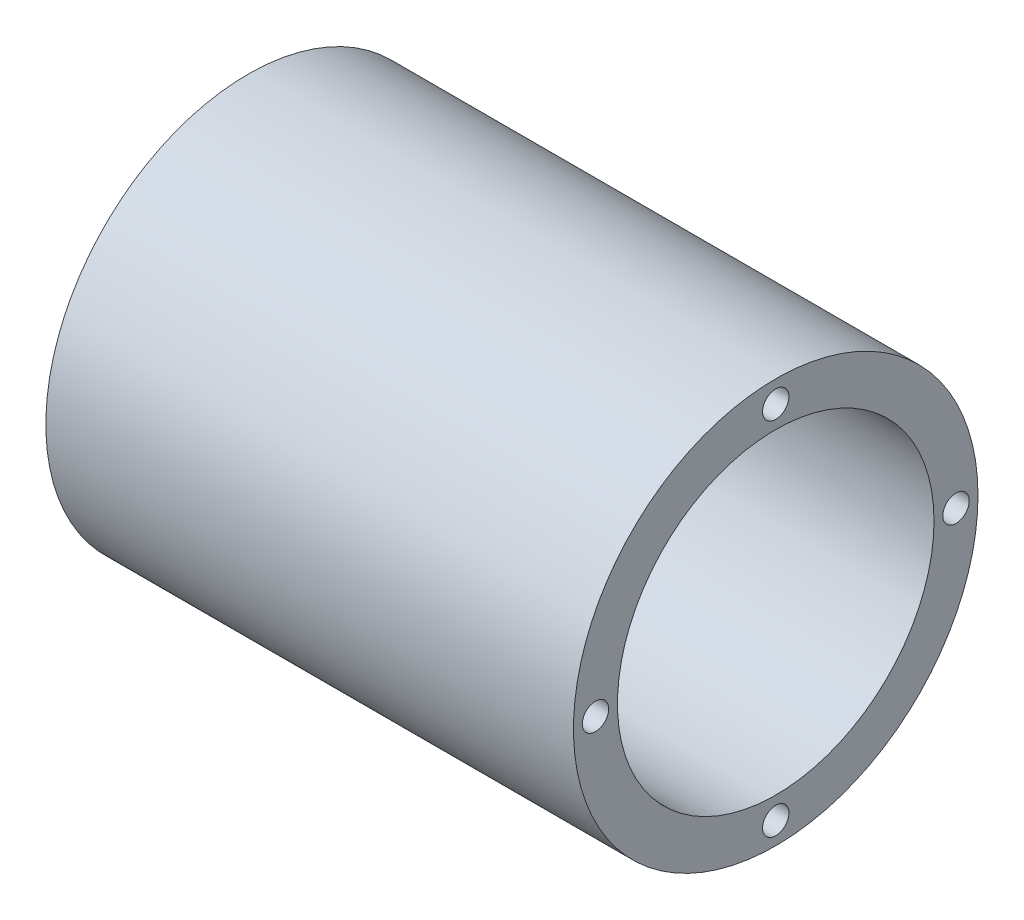
ISO-10303-21;
HEADER;
FILE_DESCRIPTION(('STEP AP214'),'2;1');
FILE_NAME('part.step','',(''),(''),'','','');
FILE_SCHEMA(('AUTOMOTIVE_DESIGN { 1 0 10303 214 1 1 1 1 }'));
ENDSEC;
DATA;
#1=APPLICATION_CONTEXT('core data for automotive mechanical design processes');
#2=APPLICATION_PROTOCOL_DEFINITION('international standard','automotive_design',2000,#1);
#3=PRODUCT_CONTEXT('',#1,'mechanical');
#4=PRODUCT('Part','Part','',(#3));
#5=PRODUCT_RELATED_PRODUCT_CATEGORY('part','',(#4));
#6=PRODUCT_DEFINITION_FORMATION('','',#4);
#7=PRODUCT_DEFINITION_CONTEXT('part definition',#1,'design');
#8=PRODUCT_DEFINITION('design','',#6,#7);
#9=PRODUCT_DEFINITION_SHAPE('','',#8);
#10=(LENGTH_UNIT() NAMED_UNIT(*) SI_UNIT(.MILLI.,.METRE.));
#11=(NAMED_UNIT(*) PLANE_ANGLE_UNIT() SI_UNIT($,.RADIAN.));
#12=(NAMED_UNIT(*) SI_UNIT($,.STERADIAN.) SOLID_ANGLE_UNIT());
#13=UNCERTAINTY_MEASURE_WITH_UNIT(LENGTH_MEASURE(1.E-05),#10,'distance_accuracy_value','');
#14=(GEOMETRIC_REPRESENTATION_CONTEXT(3) GLOBAL_UNCERTAINTY_ASSIGNED_CONTEXT((#13)) GLOBAL_UNIT_ASSIGNED_CONTEXT((#10,
#11,#12)) REPRESENTATION_CONTEXT('',''));
#15=CARTESIAN_POINT('',(0.,0.,0.));
#16=DIRECTION('',(0.,0.,1.));
#17=DIRECTION('',(1.,0.,0.));
#18=AXIS2_PLACEMENT_3D('',#15,#16,#17);
#19=CARTESIAN_POINT('',(3.,0.,-8.5));
#20=DIRECTION('',(-1.,0.,0.));
#21=DIRECTION('',(0.,0.,1.));
#22=AXIS2_PLACEMENT_3D('',#19,#20,#21);
#23=CYLINDRICAL_SURFACE('',#22,3.);
#24=CARTESIAN_POINT('',(0.,0.,-8.5));
#25=DIRECTION('',(1.,0.,0.));
#26=DIRECTION('',(0.,0.,-1.));
#27=AXIS2_PLACEMENT_3D('',#24,#25,#26);
#28=CIRCLE('',#27,3.);
#29=CARTESIAN_POINT('',(0.,0.,-11.5));
#30=VERTEX_POINT('',#29);
#31=EDGE_CURVE('E109',#30,#30,#28,.T.);
#32=ORIENTED_EDGE('',*,*,#31,.F.);
#33=EDGE_LOOP('',(#32));
#34=FACE_BOUND('',#33,.T.);
#35=CARTESIAN_POINT('',(3.,0.,-8.5));
#36=DIRECTION('',(1.,0.,0.));
#37=DIRECTION('',(0.,0.,-1.));
#38=AXIS2_PLACEMENT_3D('',#35,#36,#37);
#39=CIRCLE('',#38,3.);
#40=CARTESIAN_POINT('',(3.,0.,-11.5));
#41=VERTEX_POINT('',#40);
#42=EDGE_CURVE('E161',#41,#41,#39,.T.);
#43=ORIENTED_EDGE('',*,*,#42,.T.);
#44=EDGE_LOOP('',(#43));
#45=FACE_BOUND('',#44,.T.);
#46=ADVANCED_FACE('F89',(#34,#45),#23,.F.);
#47=CARTESIAN_POINT('',(3.,-8.5,0.));
#48=DIRECTION('',(-1.,0.,0.));
#49=DIRECTION('',(0.,0.,1.));
#50=AXIS2_PLACEMENT_3D('',#47,#48,#49);
#51=CYLINDRICAL_SURFACE('',#50,3.);
#52=CARTESIAN_POINT('',(0.,-8.5,0.));
#53=DIRECTION('',(1.,0.,0.));
#54=DIRECTION('',(0.,0.,-1.));
#55=AXIS2_PLACEMENT_3D('',#52,#53,#54);
#56=CIRCLE('',#55,3.);
#57=CARTESIAN_POINT('',(0.,-8.5,-2.99999999999994));
#58=VERTEX_POINT('',#57);
#59=EDGE_CURVE('E100',#58,#58,#56,.T.);
#60=ORIENTED_EDGE('',*,*,#59,.F.);
#61=EDGE_LOOP('',(#60));
#62=FACE_BOUND('',#61,.T.);
#63=CARTESIAN_POINT('',(3.,-8.5,0.));
#64=DIRECTION('',(1.,0.,0.));
#65=DIRECTION('',(0.,0.,-1.));
#66=AXIS2_PLACEMENT_3D('',#63,#64,#65);
#67=CIRCLE('',#66,3.);
#68=CARTESIAN_POINT('',(3.,-8.5,-2.99999999999994));
#69=VERTEX_POINT('',#68);
#70=EDGE_CURVE('E152',#69,#69,#67,.T.);
#71=ORIENTED_EDGE('',*,*,#70,.T.);
#72=EDGE_LOOP('',(#71));
#73=FACE_BOUND('',#72,.T.);
#74=ADVANCED_FACE('F207',(#62,#73),#51,.F.);
#75=CARTESIAN_POINT('',(3.,0.,8.5));
#76=DIRECTION('',(-1.,0.,0.));
#77=DIRECTION('',(0.,0.,1.));
#78=AXIS2_PLACEMENT_3D('',#75,#76,#77);
#79=CYLINDRICAL_SURFACE('',#78,3.);
#80=CARTESIAN_POINT('',(0.,0.,8.5));
#81=DIRECTION('',(1.,0.,0.));
#82=DIRECTION('',(0.,0.,-1.));
#83=AXIS2_PLACEMENT_3D('',#80,#81,#82);
#84=CIRCLE('',#83,3.);
#85=CARTESIAN_POINT('',(0.,0.,5.5));
#86=VERTEX_POINT('',#85);
#87=EDGE_CURVE('E112',#86,#86,#84,.T.);
#88=ORIENTED_EDGE('',*,*,#87,.F.);
#89=EDGE_LOOP('',(#88));
#90=FACE_BOUND('',#89,.T.);
#91=CARTESIAN_POINT('',(3.,0.,8.5));
#92=DIRECTION('',(1.,0.,0.));
#93=DIRECTION('',(0.,0.,-1.));
#94=AXIS2_PLACEMENT_3D('',#91,#92,#93);
#95=CIRCLE('',#94,3.);
#96=CARTESIAN_POINT('',(3.,0.,5.5));
#97=VERTEX_POINT('',#96);
#98=EDGE_CURVE('E143',#97,#97,#95,.T.);
#99=ORIENTED_EDGE('',*,*,#98,.T.);
#100=EDGE_LOOP('',(#99));
#101=FACE_BOUND('',#100,.T.);
#102=ADVANCED_FACE('F213',(#90,#101),#79,.F.);
#103=CARTESIAN_POINT('',(3.,8.5,0.));
#104=DIRECTION('',(-1.,0.,0.));
#105=DIRECTION('',(0.,0.,1.));
#106=AXIS2_PLACEMENT_3D('',#103,#104,#105);
#107=CYLINDRICAL_SURFACE('',#106,3.);
#108=CARTESIAN_POINT('',(0.,8.5,0.));
#109=DIRECTION('',(1.,0.,0.));
#110=DIRECTION('',(0.,0.,-1.));
#111=AXIS2_PLACEMENT_3D('',#108,#109,#110);
#112=CIRCLE('',#111,3.);
#113=CARTESIAN_POINT('',(0.,8.5,-3.));
#114=VERTEX_POINT('',#113);
#115=EDGE_CURVE('E96',#114,#114,#112,.T.);
#116=ORIENTED_EDGE('',*,*,#115,.F.);
#117=EDGE_LOOP('',(#116));
#118=FACE_BOUND('',#117,.T.);
#119=CARTESIAN_POINT('',(3.,8.5,0.));
#120=DIRECTION('',(1.,0.,0.));
#121=DIRECTION('',(0.,0.,-1.));
#122=AXIS2_PLACEMENT_3D('',#119,#120,#121);
#123=CIRCLE('',#122,3.);
#124=CARTESIAN_POINT('',(3.,8.5,-3.));
#125=VERTEX_POINT('',#124);
#126=EDGE_CURVE('E129',#125,#125,#123,.T.);
#127=ORIENTED_EDGE('',*,*,#126,.T.);
#128=EDGE_LOOP('',(#127));
#129=FACE_BOUND('',#128,.T.);
#130=ADVANCED_FACE('F221',(#118,#129),#107,.F.);
#131=CARTESIAN_POINT('',(-11.,0.,0.));
#132=DIRECTION('',(1.,0.,0.));
#133=DIRECTION('',(0.,0.,-1.));
#134=AXIS2_PLACEMENT_3D('',#131,#132,#133);
#135=CYLINDRICAL_SURFACE('',#134,23.);
#136=CARTESIAN_POINT('',(0.,0.,0.));
#137=DIRECTION('',(1.,0.,0.));
#138=DIRECTION('',(0.,0.,-1.));
#139=AXIS2_PLACEMENT_3D('',#136,#137,#138);
#140=CIRCLE('',#139,23.);
#141=CARTESIAN_POINT('',(0.,0.,-23.));
#142=VERTEX_POINT('',#141);
#143=EDGE_CURVE('E170',#142,#142,#140,.T.);
#144=ORIENTED_EDGE('',*,*,#143,.T.);
#145=EDGE_LOOP('',(#144));
#146=FACE_BOUND('',#145,.T.);
#147=CARTESIAN_POINT('',(60.,0.,0.));
#148=DIRECTION('',(1.,0.,0.));
#149=DIRECTION('',(0.,0.,-1.));
#150=AXIS2_PLACEMENT_3D('',#147,#148,#149);
#151=CIRCLE('',#150,23.);
#152=CARTESIAN_POINT('',(60.,0.,-23.));
#153=VERTEX_POINT('',#152);
#154=EDGE_CURVE('E118',#153,#153,#151,.T.);
#155=ORIENTED_EDGE('',*,*,#154,.F.);
#156=EDGE_LOOP('',(#155));
#157=FACE_BOUND('',#156,.T.);
#158=ADVANCED_FACE('F91',(#146,#157),#135,.T.);
#159=CARTESIAN_POINT('',(0.,0.,0.));
#160=DIRECTION('',(1.,0.,0.));
#161=DIRECTION('',(0.,0.,-1.));
#162=AXIS2_PLACEMENT_3D('',#159,#160,#161);
#163=PLANE('',#162);
#164=ORIENTED_EDGE('',*,*,#115,.T.);
#165=EDGE_LOOP('',(#164));
#166=FACE_BOUND('',#165,.T.);
#167=ORIENTED_EDGE('',*,*,#59,.T.);
#168=EDGE_LOOP('',(#167));
#169=FACE_BOUND('',#168,.T.);
#170=CARTESIAN_POINT('',(0.,0.,0.));
#171=DIRECTION('',(1.,0.,0.));
#172=DIRECTION('',(0.,0.,-1.));
#173=AXIS2_PLACEMENT_3D('',#170,#171,#172);
#174=CIRCLE('',#173,5.25);
#175=CARTESIAN_POINT('',(0.,0.,-5.25));
#176=VERTEX_POINT('',#175);
#177=EDGE_CURVE('E104',#176,#176,#174,.T.);
#178=ORIENTED_EDGE('',*,*,#177,.T.);
#179=EDGE_LOOP('',(#178));
#180=FACE_BOUND('',#179,.T.);
#181=ORIENTED_EDGE('',*,*,#31,.T.);
#182=EDGE_LOOP('',(#181));
#183=FACE_BOUND('',#182,.T.);
#184=ORIENTED_EDGE('',*,*,#87,.T.);
#185=EDGE_LOOP('',(#184));
#186=FACE_BOUND('',#185,.T.);
#187=ORIENTED_EDGE('',*,*,#143,.F.);
#188=EDGE_LOOP('',(#187));
#189=FACE_BOUND('',#188,.T.);
#190=ADVANCED_FACE('F344',(#166,#169,#180,#183,#186,#189),#163,.F.);
#191=CARTESIAN_POINT('',(3.,0.,0.));
#192=DIRECTION('',(-1.,0.,0.));
#193=DIRECTION('',(0.,0.,1.));
#194=AXIS2_PLACEMENT_3D('',#191,#192,#193);
#195=CYLINDRICAL_SURFACE('',#194,5.25);
#196=ORIENTED_EDGE('',*,*,#177,.F.);
#197=EDGE_LOOP('',(#196));
#198=FACE_BOUND('',#197,.T.);
#199=CARTESIAN_POINT('',(6.,0.,0.));
#200=DIRECTION('',(1.,0.,0.));
#201=DIRECTION('',(0.,0.,-1.));
#202=AXIS2_PLACEMENT_3D('',#199,#200,#201);
#203=CIRCLE('',#202,5.25);
#204=CARTESIAN_POINT('',(6.,0.,-5.25));
#205=VERTEX_POINT('',#204);
#206=EDGE_CURVE('E115',#205,#205,#203,.T.);
#207=ORIENTED_EDGE('',*,*,#206,.T.);
#208=EDGE_LOOP('',(#207));
#209=FACE_BOUND('',#208,.T.);
#210=ADVANCED_FACE('F219',(#198,#209),#195,.F.);
#211=CARTESIAN_POINT('',(6.,0.,0.));
#212=DIRECTION('',(1.,0.,0.));
#213=DIRECTION('',(0.,0.,-1.));
#214=AXIS2_PLACEMENT_3D('',#211,#212,#213);
#215=PLANE('',#214);
#216=CARTESIAN_POINT('',(6.,0.,0.));
#217=DIRECTION('',(1.,0.,0.));
#218=DIRECTION('',(0.,0.,-1.));
#219=AXIS2_PLACEMENT_3D('',#216,#217,#218);
#220=CIRCLE('',#219,18.);
#221=CARTESIAN_POINT('',(6.,0.,-18.));
#222=VERTEX_POINT('',#221);
#223=EDGE_CURVE('E11',#222,#222,#220,.F.);
#224=ORIENTED_EDGE('',*,*,#223,.F.);
#225=EDGE_LOOP('',(#224));
#226=FACE_BOUND('',#225,.T.);
#227=ORIENTED_EDGE('',*,*,#206,.F.);
#228=EDGE_LOOP('',(#227));
#229=FACE_BOUND('',#228,.T.);
#230=CARTESIAN_POINT('',(6.,8.5,0.));
#231=DIRECTION('',(1.,0.,0.));
#232=DIRECTION('',(0.,0.,-1.));
#233=AXIS2_PLACEMENT_3D('',#230,#231,#232);
#234=CIRCLE('',#233,1.5);
#235=CARTESIAN_POINT('',(6.,8.5,-1.5));
#236=VERTEX_POINT('',#235);
#237=EDGE_CURVE('E140',#236,#236,#234,.T.);
#238=ORIENTED_EDGE('',*,*,#237,.F.);
#239=EDGE_LOOP('',(#238));
#240=FACE_BOUND('',#239,.T.);
#241=CARTESIAN_POINT('',(6.,0.,8.5));
#242=DIRECTION('',(1.,0.,0.));
#243=DIRECTION('',(0.,0.,-1.));
#244=AXIS2_PLACEMENT_3D('',#241,#242,#243);
#245=CIRCLE('',#244,1.5);
#246=CARTESIAN_POINT('',(6.,0.,7.));
#247=VERTEX_POINT('',#246);
#248=EDGE_CURVE('E149',#247,#247,#245,.T.);
#249=ORIENTED_EDGE('',*,*,#248,.F.);
#250=EDGE_LOOP('',(#249));
#251=FACE_BOUND('',#250,.T.);
#252=CARTESIAN_POINT('',(6.,-8.5,0.));
#253=DIRECTION('',(1.,0.,0.));
#254=DIRECTION('',(0.,0.,-1.));
#255=AXIS2_PLACEMENT_3D('',#252,#253,#254);
#256=CIRCLE('',#255,1.5);
#257=CARTESIAN_POINT('',(6.,-8.5,-1.49999999999994));
#258=VERTEX_POINT('',#257);
#259=EDGE_CURVE('E158',#258,#258,#256,.T.);
#260=ORIENTED_EDGE('',*,*,#259,.F.);
#261=EDGE_LOOP('',(#260));
#262=FACE_BOUND('',#261,.T.);
#263=CARTESIAN_POINT('',(6.,0.,-8.5));
#264=DIRECTION('',(1.,0.,0.));
#265=DIRECTION('',(0.,0.,-1.));
#266=AXIS2_PLACEMENT_3D('',#263,#264,#265);
#267=CIRCLE('',#266,1.5);
#268=CARTESIAN_POINT('',(6.,0.,-10.));
#269=VERTEX_POINT('',#268);
#270=EDGE_CURVE('E167',#269,#269,#267,.T.);
#271=ORIENTED_EDGE('',*,*,#270,.F.);
#272=EDGE_LOOP('',(#271));
#273=FACE_BOUND('',#272,.T.);
#274=ADVANCED_FACE('F396',(#226,#229,#240,#251,#262,#273),#215,.T.);
#275=CARTESIAN_POINT('',(60.,0.,0.));
#276=DIRECTION('',(-1.,0.,0.));
#277=DIRECTION('',(0.,0.,1.));
#278=AXIS2_PLACEMENT_3D('',#275,#276,#277);
#279=CYLINDRICAL_SURFACE('',#278,18.);
#280=ORIENTED_EDGE('',*,*,#223,.T.);
#281=EDGE_LOOP('',(#280));
#282=FACE_BOUND('',#281,.T.);
#283=CARTESIAN_POINT('',(60.,0.,0.));
#284=DIRECTION('',(1.,0.,0.));
#285=DIRECTION('',(0.,0.,-1.));
#286=AXIS2_PLACEMENT_3D('',#283,#284,#285);
#287=CIRCLE('',#286,18.);
#288=CARTESIAN_POINT('',(60.,0.,-18.));
#289=VERTEX_POINT('',#288);
#290=EDGE_CURVE('E121',#289,#289,#287,.T.);
#291=ORIENTED_EDGE('',*,*,#290,.T.);
#292=EDGE_LOOP('',(#291));
#293=FACE_BOUND('',#292,.T.);
#294=ADVANCED_FACE('F401',(#282,#293),#279,.F.);
#295=CARTESIAN_POINT('',(60.,0.,0.));
#296=DIRECTION('',(1.,0.,0.));
#297=DIRECTION('',(0.,0.,-1.));
#298=AXIS2_PLACEMENT_3D('',#295,#296,#297);
#299=PLANE('',#298);
#300=CARTESIAN_POINT('',(60.,20.5,0.));
#301=DIRECTION('',(1.,0.,0.));
#302=DIRECTION('',(0.,0.,-1.));
#303=AXIS2_PLACEMENT_3D('',#300,#301,#302);
#304=CIRCLE('',#303,1.5);
#305=CARTESIAN_POINT('',(60.,20.5,-1.5));
#306=VERTEX_POINT('',#305);
#307=EDGE_CURVE('E124',#306,#306,#304,.T.);
#308=ORIENTED_EDGE('',*,*,#307,.F.);
#309=EDGE_LOOP('',(#308));
#310=FACE_BOUND('',#309,.T.);
#311=CARTESIAN_POINT('',(60.,5.78573092716117E-13,-20.5000000000006));
#312=DIRECTION('',(1.,0.,0.));
#313=DIRECTION('',(0.,0.,-1.));
#314=AXIS2_PLACEMENT_3D('',#311,#312,#313);
#315=CIRCLE('',#314,1.50000000000045);
#316=CARTESIAN_POINT('',(60.,5.78573092716117E-13,-22.000000000001));
#317=VERTEX_POINT('',#316);
#318=EDGE_CURVE('E132',#317,#317,#315,.T.);
#319=ORIENTED_EDGE('',*,*,#318,.F.);
#320=EDGE_LOOP('',(#319));
#321=FACE_BOUND('',#320,.T.);
#322=CARTESIAN_POINT('',(60.,-20.5,-1.15745234713202E-12));
#323=DIRECTION('',(1.,0.,0.));
#324=DIRECTION('',(0.,0.,-1.));
#325=AXIS2_PLACEMENT_3D('',#322,#323,#324);
#326=CIRCLE('',#325,1.50000000000124);
#327=CARTESIAN_POINT('',(60.,-20.5,-1.5000000000024));
#328=VERTEX_POINT('',#327);
#329=EDGE_CURVE('E128',#328,#328,#326,.T.);
#330=ORIENTED_EDGE('',*,*,#329,.F.);
#331=EDGE_LOOP('',(#330));
#332=FACE_BOUND('',#331,.T.);
#333=CARTESIAN_POINT('',(60.,-5.81083618654369E-13,20.4999999999994));
#334=DIRECTION('',(1.,0.,0.));
#335=DIRECTION('',(0.,0.,-1.));
#336=AXIS2_PLACEMENT_3D('',#333,#334,#335);
#337=CIRCLE('',#336,1.50000000000093);
#338=CARTESIAN_POINT('',(60.,-5.81083618654369E-13,18.9999999999985));
#339=VERTEX_POINT('',#338);
#340=EDGE_CURVE('E125',#339,#339,#337,.T.);
#341=ORIENTED_EDGE('',*,*,#340,.F.);
#342=EDGE_LOOP('',(#341));
#343=FACE_BOUND('',#342,.T.);
#344=ORIENTED_EDGE('',*,*,#290,.F.);
#345=EDGE_LOOP('',(#344));
#346=FACE_BOUND('',#345,.T.);
#347=ORIENTED_EDGE('',*,*,#154,.T.);
#348=EDGE_LOOP('',(#347));
#349=FACE_BOUND('',#348,.T.);
#350=ADVANCED_FACE('F336',(#310,#321,#332,#343,#346,#349),#299,.T.);
#351=CARTESIAN_POINT('',(55.,-5.81083618654369E-13,20.4999999999994));
#352=DIRECTION('',(1.,0.,0.));
#353=DIRECTION('',(0.,0.,-1.));
#354=AXIS2_PLACEMENT_3D('',#351,#352,#353);
#355=CYLINDRICAL_SURFACE('',#354,1.50000000000093);
#356=ORIENTED_EDGE('',*,*,#340,.T.);
#357=EDGE_LOOP('',(#356));
#358=FACE_BOUND('',#357,.T.);
#359=CARTESIAN_POINT('',(51.,-5.81083618654369E-13,20.4999999999994));
#360=DIRECTION('',(1.,0.,0.));
#361=DIRECTION('',(0.,0.,-1.));
#362=AXIS2_PLACEMENT_3D('',#359,#360,#361);
#363=CIRCLE('',#362,1.50000000000093);
#364=CARTESIAN_POINT('',(51.,-5.81083618654369E-13,18.9999999999985));
#365=VERTEX_POINT('',#364);
#366=EDGE_CURVE('E176',#365,#365,#363,.T.);
#367=ORIENTED_EDGE('',*,*,#366,.F.);
#368=EDGE_LOOP('',(#367));
#369=FACE_BOUND('',#368,.T.);
#370=ADVANCED_FACE('F324',(#358,#369),#355,.F.);
#371=CARTESIAN_POINT('',(55.,-20.5,-1.15745234713202E-12));
#372=DIRECTION('',(1.,0.,0.));
#373=DIRECTION('',(0.,0.,-1.));
#374=AXIS2_PLACEMENT_3D('',#371,#372,#373);
#375=CYLINDRICAL_SURFACE('',#374,1.50000000000124);
#376=ORIENTED_EDGE('',*,*,#329,.T.);
#377=EDGE_LOOP('',(#376));
#378=FACE_BOUND('',#377,.T.);
#379=CARTESIAN_POINT('',(51.,-20.5,-1.15745234713202E-12));
#380=DIRECTION('',(1.,0.,0.));
#381=DIRECTION('',(0.,0.,-1.));
#382=AXIS2_PLACEMENT_3D('',#379,#380,#381);
#383=CIRCLE('',#382,1.50000000000124);
#384=CARTESIAN_POINT('',(51.,-20.5,-1.5000000000024));
#385=VERTEX_POINT('',#384);
#386=EDGE_CURVE('E179',#385,#385,#383,.T.);
#387=ORIENTED_EDGE('',*,*,#386,.F.);
#388=EDGE_LOOP('',(#387));
#389=FACE_BOUND('',#388,.T.);
#390=ADVANCED_FACE('F203',(#378,#389),#375,.F.);
#391=CARTESIAN_POINT('',(55.,5.78573092716117E-13,-20.5000000000006));
#392=DIRECTION('',(1.,0.,0.));
#393=DIRECTION('',(0.,0.,-1.));
#394=AXIS2_PLACEMENT_3D('',#391,#392,#393);
#395=CYLINDRICAL_SURFACE('',#394,1.50000000000045);
#396=ORIENTED_EDGE('',*,*,#318,.T.);
#397=EDGE_LOOP('',(#396));
#398=FACE_BOUND('',#397,.T.);
#399=CARTESIAN_POINT('',(51.,5.78573092716117E-13,-20.5000000000006));
#400=DIRECTION('',(1.,0.,0.));
#401=DIRECTION('',(0.,0.,-1.));
#402=AXIS2_PLACEMENT_3D('',#399,#400,#401);
#403=CIRCLE('',#402,1.50000000000045);
#404=CARTESIAN_POINT('',(51.,5.78573092716117E-13,-22.000000000001));
#405=VERTEX_POINT('',#404);
#406=EDGE_CURVE('E182',#405,#405,#403,.T.);
#407=ORIENTED_EDGE('',*,*,#406,.F.);
#408=EDGE_LOOP('',(#407));
#409=FACE_BOUND('',#408,.T.);
#410=ADVANCED_FACE('F193',(#398,#409),#395,.F.);
#411=CARTESIAN_POINT('',(55.,20.5,0.));
#412=DIRECTION('',(1.,0.,0.));
#413=DIRECTION('',(0.,0.,-1.));
#414=AXIS2_PLACEMENT_3D('',#411,#412,#413);
#415=CYLINDRICAL_SURFACE('',#414,1.5);
#416=ORIENTED_EDGE('',*,*,#307,.T.);
#417=EDGE_LOOP('',(#416));
#418=FACE_BOUND('',#417,.T.);
#419=CARTESIAN_POINT('',(51.,20.5,0.));
#420=DIRECTION('',(1.,0.,0.));
#421=DIRECTION('',(0.,0.,-1.));
#422=AXIS2_PLACEMENT_3D('',#419,#420,#421);
#423=CIRCLE('',#422,1.5);
#424=CARTESIAN_POINT('',(51.,20.5,-1.5));
#425=VERTEX_POINT('',#424);
#426=EDGE_CURVE('E175',#425,#425,#423,.T.);
#427=ORIENTED_EDGE('',*,*,#426,.F.);
#428=EDGE_LOOP('',(#427));
#429=FACE_BOUND('',#428,.T.);
#430=ADVANCED_FACE('F190',(#418,#429),#415,.F.);
#431=CARTESIAN_POINT('',(3.,8.5,0.));
#432=DIRECTION('',(1.,0.,0.));
#433=DIRECTION('',(0.,0.,-1.));
#434=AXIS2_PLACEMENT_3D('',#431,#432,#433);
#435=PLANE('',#434);
#436=CARTESIAN_POINT('',(3.,8.5,0.));
#437=DIRECTION('',(1.,0.,0.));
#438=DIRECTION('',(0.,0.,-1.));
#439=AXIS2_PLACEMENT_3D('',#436,#437,#438);
#440=CIRCLE('',#439,1.5);
#441=CARTESIAN_POINT('',(3.,8.5,-1.5));
#442=VERTEX_POINT('',#441);
#443=EDGE_CURVE('E139',#442,#442,#440,.T.);
#444=ORIENTED_EDGE('',*,*,#443,.T.);
#445=EDGE_LOOP('',(#444));
#446=FACE_BOUND('',#445,.T.);
#447=ORIENTED_EDGE('',*,*,#126,.F.);
#448=EDGE_LOOP('',(#447));
#449=FACE_BOUND('',#448,.T.);
#450=ADVANCED_FACE('F192',(#446,#449),#435,.F.);
#451=CARTESIAN_POINT('',(3.,8.5,0.));
#452=DIRECTION('',(1.,0.,0.));
#453=DIRECTION('',(0.,0.,-1.));
#454=AXIS2_PLACEMENT_3D('',#451,#452,#453);
#455=CYLINDRICAL_SURFACE('',#454,1.5);
#456=ORIENTED_EDGE('',*,*,#443,.F.);
#457=EDGE_LOOP('',(#456));
#458=FACE_BOUND('',#457,.T.);
#459=ORIENTED_EDGE('',*,*,#237,.T.);
#460=EDGE_LOOP('',(#459));
#461=FACE_BOUND('',#460,.T.);
#462=ADVANCED_FACE('F200',(#458,#461),#455,.F.);
#463=CARTESIAN_POINT('',(3.,0.,8.5));
#464=DIRECTION('',(1.,0.,0.));
#465=DIRECTION('',(0.,0.,-1.));
#466=AXIS2_PLACEMENT_3D('',#463,#464,#465);
#467=PLANE('',#466);
#468=CARTESIAN_POINT('',(3.,0.,8.5));
#469=DIRECTION('',(1.,0.,0.));
#470=DIRECTION('',(0.,0.,-1.));
#471=AXIS2_PLACEMENT_3D('',#468,#469,#470);
#472=CIRCLE('',#471,1.5);
#473=CARTESIAN_POINT('',(3.,0.,7.));
#474=VERTEX_POINT('',#473);
#475=EDGE_CURVE('E148',#474,#474,#472,.T.);
#476=ORIENTED_EDGE('',*,*,#475,.T.);
#477=EDGE_LOOP('',(#476));
#478=FACE_BOUND('',#477,.T.);
#479=ORIENTED_EDGE('',*,*,#98,.F.);
#480=EDGE_LOOP('',(#479));
#481=FACE_BOUND('',#480,.T.);
#482=ADVANCED_FACE('F232',(#478,#481),#467,.F.);
#483=CARTESIAN_POINT('',(3.,0.,8.5));
#484=DIRECTION('',(1.,0.,0.));
#485=DIRECTION('',(0.,0.,-1.));
#486=AXIS2_PLACEMENT_3D('',#483,#484,#485);
#487=CYLINDRICAL_SURFACE('',#486,1.5);
#488=ORIENTED_EDGE('',*,*,#475,.F.);
#489=EDGE_LOOP('',(#488));
#490=FACE_BOUND('',#489,.T.);
#491=ORIENTED_EDGE('',*,*,#248,.T.);
#492=EDGE_LOOP('',(#491));
#493=FACE_BOUND('',#492,.T.);
#494=ADVANCED_FACE('F234',(#490,#493),#487,.F.);
#495=CARTESIAN_POINT('',(3.,-8.5,0.));
#496=DIRECTION('',(1.,0.,0.));
#497=DIRECTION('',(0.,0.,-1.));
#498=AXIS2_PLACEMENT_3D('',#495,#496,#497);
#499=PLANE('',#498);
#500=CARTESIAN_POINT('',(3.,-8.5,0.));
#501=DIRECTION('',(1.,0.,0.));
#502=DIRECTION('',(0.,0.,-1.));
#503=AXIS2_PLACEMENT_3D('',#500,#501,#502);
#504=CIRCLE('',#503,1.5);
#505=CARTESIAN_POINT('',(3.,-8.5,-1.49999999999994));
#506=VERTEX_POINT('',#505);
#507=EDGE_CURVE('E157',#506,#506,#504,.T.);
#508=ORIENTED_EDGE('',*,*,#507,.T.);
#509=EDGE_LOOP('',(#508));
#510=FACE_BOUND('',#509,.T.);
#511=ORIENTED_EDGE('',*,*,#70,.F.);
#512=EDGE_LOOP('',(#511));
#513=FACE_BOUND('',#512,.T.);
#514=ADVANCED_FACE('F241',(#510,#513),#499,.F.);
#515=CARTESIAN_POINT('',(3.,-8.5,0.));
#516=DIRECTION('',(1.,0.,0.));
#517=DIRECTION('',(0.,0.,-1.));
#518=AXIS2_PLACEMENT_3D('',#515,#516,#517);
#519=CYLINDRICAL_SURFACE('',#518,1.5);
#520=ORIENTED_EDGE('',*,*,#507,.F.);
#521=EDGE_LOOP('',(#520));
#522=FACE_BOUND('',#521,.T.);
#523=ORIENTED_EDGE('',*,*,#259,.T.);
#524=EDGE_LOOP('',(#523));
#525=FACE_BOUND('',#524,.T.);
#526=ADVANCED_FACE('F249',(#522,#525),#519,.F.);
#527=CARTESIAN_POINT('',(3.,0.,-8.5));
#528=DIRECTION('',(1.,0.,0.));
#529=DIRECTION('',(0.,0.,-1.));
#530=AXIS2_PLACEMENT_3D('',#527,#528,#529);
#531=PLANE('',#530);
#532=CARTESIAN_POINT('',(3.,0.,-8.5));
#533=DIRECTION('',(1.,0.,0.));
#534=DIRECTION('',(0.,0.,-1.));
#535=AXIS2_PLACEMENT_3D('',#532,#533,#534);
#536=CIRCLE('',#535,1.5);
#537=CARTESIAN_POINT('',(3.,0.,-10.));
#538=VERTEX_POINT('',#537);
#539=EDGE_CURVE('E166',#538,#538,#536,.T.);
#540=ORIENTED_EDGE('',*,*,#539,.T.);
#541=EDGE_LOOP('',(#540));
#542=FACE_BOUND('',#541,.T.);
#543=ORIENTED_EDGE('',*,*,#42,.F.);
#544=EDGE_LOOP('',(#543));
#545=FACE_BOUND('',#544,.T.);
#546=ADVANCED_FACE('F253',(#542,#545),#531,.F.);
#547=CARTESIAN_POINT('',(3.,0.,-8.5));
#548=DIRECTION('',(1.,0.,0.));
#549=DIRECTION('',(0.,0.,-1.));
#550=AXIS2_PLACEMENT_3D('',#547,#548,#549);
#551=CYLINDRICAL_SURFACE('',#550,1.5);
#552=ORIENTED_EDGE('',*,*,#539,.F.);
#553=EDGE_LOOP('',(#552));
#554=FACE_BOUND('',#553,.T.);
#555=ORIENTED_EDGE('',*,*,#270,.T.);
#556=EDGE_LOOP('',(#555));
#557=FACE_BOUND('',#556,.T.);
#558=ADVANCED_FACE('F257',(#554,#557),#551,.F.);
#559=CARTESIAN_POINT('',(51.,20.5,0.));
#560=DIRECTION('',(1.,0.,0.));
#561=DIRECTION('',(0.,0.,-1.));
#562=AXIS2_PLACEMENT_3D('',#559,#560,#561);
#563=PLANE('',#562);
#564=ORIENTED_EDGE('',*,*,#426,.T.);
#565=EDGE_LOOP('',(#564));
#566=FACE_BOUND('',#565,.T.);
#567=ADVANCED_FACE('F188',(#566),#563,.T.);
#568=CARTESIAN_POINT('',(51.,5.78573092716117E-13,-20.5000000000006));
#569=DIRECTION('',(1.,0.,0.));
#570=DIRECTION('',(0.,0.,-1.));
#571=AXIS2_PLACEMENT_3D('',#568,#569,#570);
#572=PLANE('',#571);
#573=ORIENTED_EDGE('',*,*,#406,.T.);
#574=EDGE_LOOP('',(#573));
#575=FACE_BOUND('',#574,.T.);
#576=ADVANCED_FACE('F269',(#575),#572,.T.);
#577=CARTESIAN_POINT('',(51.,-20.5,-1.15745234713202E-12));
#578=DIRECTION('',(1.,0.,0.));
#579=DIRECTION('',(0.,0.,-1.));
#580=AXIS2_PLACEMENT_3D('',#577,#578,#579);
#581=PLANE('',#580);
#582=ORIENTED_EDGE('',*,*,#386,.T.);
#583=EDGE_LOOP('',(#582));
#584=FACE_BOUND('',#583,.T.);
#585=ADVANCED_FACE('F265',(#584),#581,.T.);
#586=CARTESIAN_POINT('',(51.,-5.81083618654369E-13,20.4999999999994));
#587=DIRECTION('',(1.,0.,0.));
#588=DIRECTION('',(0.,0.,-1.));
#589=AXIS2_PLACEMENT_3D('',#586,#587,#588);
#590=PLANE('',#589);
#591=ORIENTED_EDGE('',*,*,#366,.T.);
#592=EDGE_LOOP('',(#591));
#593=FACE_BOUND('',#592,.T.);
#594=ADVANCED_FACE('F262',(#593),#590,.T.);
#595=CLOSED_SHELL('',(#46,#74,#102,#130,#158,#190,#210,#274,#294,#350,#370,#390,#410,#430,#450,
#462,#482,#494,#514,#526,#546,#558,#567,#576,#585,#594));
#596=MANIFOLD_SOLID_BREP('B2',#595);
#597=ADVANCED_BREP_SHAPE_REPRESENTATION('',(#18,#596),#14);
#598=SHAPE_DEFINITION_REPRESENTATION(#9,#597);
ENDSEC;
END-ISO-10303-21;
